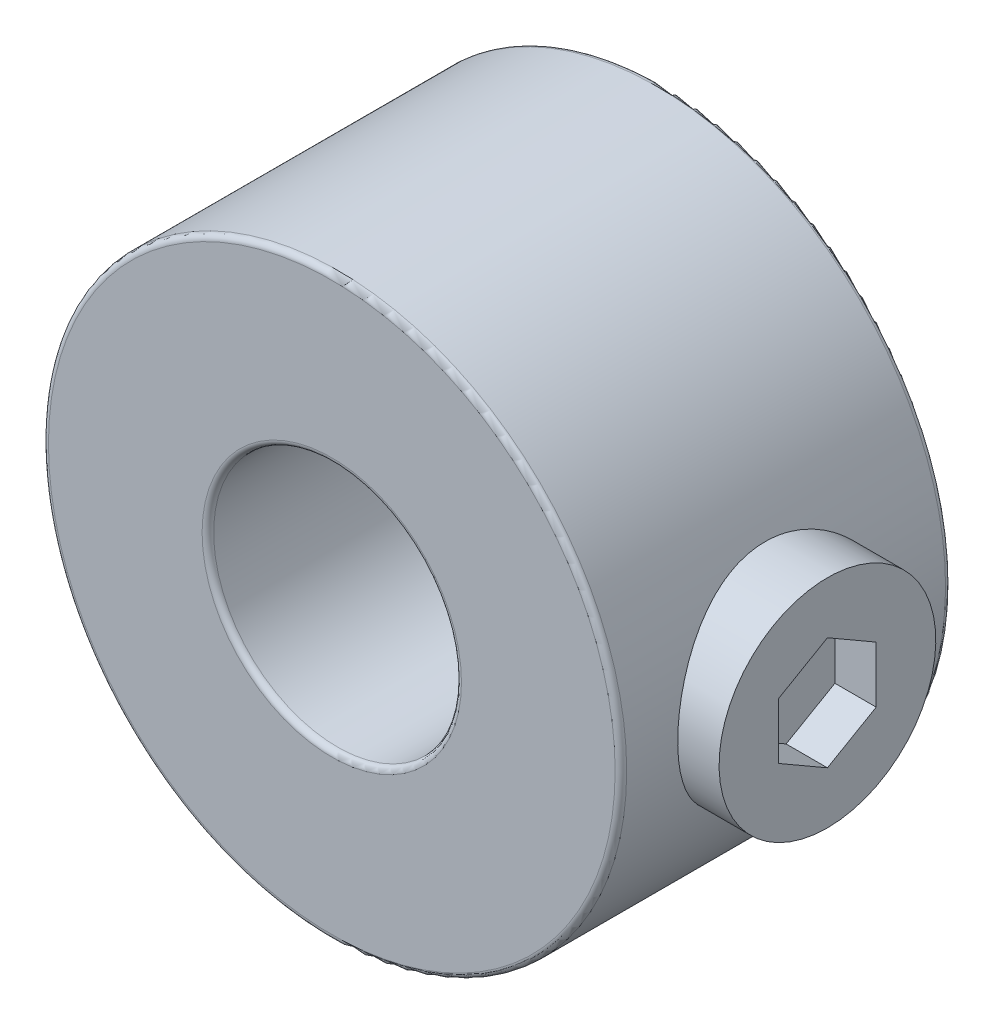
ISO-10303-21;
HEADER;
FILE_DESCRIPTION(('STEP AP214'),'2;1');
FILE_NAME('part.step','',(''),(''),'','','');
FILE_SCHEMA(('AUTOMOTIVE_DESIGN { 1 0 10303 214 1 1 1 1 }'));
ENDSEC;
DATA;
#1=APPLICATION_CONTEXT('core data for automotive mechanical design processes');
#2=APPLICATION_PROTOCOL_DEFINITION('international standard','automotive_design',2000,#1);
#3=PRODUCT_CONTEXT('',#1,'mechanical');
#4=PRODUCT('Part','Part','',(#3));
#5=PRODUCT_RELATED_PRODUCT_CATEGORY('part','',(#4));
#6=PRODUCT_DEFINITION_FORMATION('','',#4);
#7=PRODUCT_DEFINITION_CONTEXT('part definition',#1,'design');
#8=PRODUCT_DEFINITION('design','',#6,#7);
#9=PRODUCT_DEFINITION_SHAPE('','',#8);
#10=(LENGTH_UNIT() NAMED_UNIT(*) SI_UNIT(.MILLI.,.METRE.));
#11=(NAMED_UNIT(*) PLANE_ANGLE_UNIT() SI_UNIT($,.RADIAN.));
#12=(NAMED_UNIT(*) SI_UNIT($,.STERADIAN.) SOLID_ANGLE_UNIT());
#13=UNCERTAINTY_MEASURE_WITH_UNIT(LENGTH_MEASURE(1.E-05),#10,'distance_accuracy_value','');
#14=(GEOMETRIC_REPRESENTATION_CONTEXT(3) GLOBAL_UNCERTAINTY_ASSIGNED_CONTEXT((#13)) GLOBAL_UNIT_ASSIGNED_CONTEXT((#10,
#11,#12)) REPRESENTATION_CONTEXT('',''));
#15=CARTESIAN_POINT('',(0.,0.,0.));
#16=DIRECTION('',(0.,0.,1.));
#17=DIRECTION('',(1.,0.,0.));
#18=AXIS2_PLACEMENT_3D('',#15,#16,#17);
#19=CARTESIAN_POINT('',(3.175,0.,3.175));
#20=DIRECTION('',(1.,0.,0.));
#21=DIRECTION('',(0.,1.,0.));
#22=AXIS2_PLACEMENT_3D('',#19,#20,#21);
#23=PLANE('',#22);
#24=CARTESIAN_POINT('',(3.175,0.,3.175));
#25=DIRECTION('',(-1.,0.,0.));
#26=DIRECTION('',(0.,-1.,0.));
#27=AXIS2_PLACEMENT_3D('',#24,#25,#26);
#28=CIRCLE('',#27,2.0828);
#29=CARTESIAN_POINT('',(3.17500000000001,-2.08280000000001,3.175));
#30=VERTEX_POINT('',#29);
#31=EDGE_CURVE('E12',#30,#30,#28,.T.);
#32=ORIENTED_EDGE('',*,*,#31,.T.);
#33=EDGE_LOOP('',(#32));
#34=FACE_BOUND('',#33,.T.);
#35=ADVANCED_FACE('F42',(#34),#23,.F.);
#36=CARTESIAN_POINT('',(3.175,0.,3.175));
#37=DIRECTION('',(-1.,0.,0.));
#38=DIRECTION('',(0.,-1.,0.));
#39=AXIS2_PLACEMENT_3D('',#36,#37,#38);
#40=CYLINDRICAL_SURFACE('',#39,2.0828);
#41=ORIENTED_EDGE('',*,*,#31,.F.);
#42=EDGE_LOOP('',(#41));
#43=FACE_BOUND('',#42,.T.);
#44=CARTESIAN_POINT('',(6.35,0.,3.175));
#45=DIRECTION('',(-1.,0.,0.));
#46=DIRECTION('',(0.,-1.,0.));
#47=AXIS2_PLACEMENT_3D('',#44,#45,#46);
#48=CIRCLE('',#47,2.08279999999999);
#49=CARTESIAN_POINT('',(6.35000000000001,-2.08279999999999,3.175));
#50=VERTEX_POINT('',#49);
#51=EDGE_CURVE('E49',#50,#50,#48,.T.);
#52=ORIENTED_EDGE('',*,*,#51,.T.);
#53=EDGE_LOOP('',(#52));
#54=FACE_BOUND('',#53,.T.);
#55=ADVANCED_FACE('F152',(#43,#54),#40,.T.);
#56=CARTESIAN_POINT('',(6.35,0.,3.175));
#57=DIRECTION('',(-1.,0.,0.));
#58=DIRECTION('',(0.,-1.,0.));
#59=AXIS2_PLACEMENT_3D('',#56,#57,#58);
#60=PLANE('',#59);
#61=DIRECTION('',(0.,-0.5,0.866025403784439));
#62=VECTOR('',#61,1.);
#63=CARTESIAN_POINT('',(6.35,1.08225462660142,3.175));
#64=LINE('',#63,#62);
#65=CARTESIAN_POINT('',(6.34999999999999,1.08225462660142,3.175));
#66=VERTEX_POINT('',#65);
#67=CARTESIAN_POINT('',(6.35,0.541127313300754,4.11226));
#68=VERTEX_POINT('',#67);
#69=EDGE_CURVE('E110',#66,#68,#64,.T.);
#70=ORIENTED_EDGE('',*,*,#69,.F.);
#71=DIRECTION('',(0.,0.5,0.866025403784438));
#72=VECTOR('',#71,1.);
#73=CARTESIAN_POINT('',(6.35,0.541127313300753,2.23774));
#74=LINE('',#73,#72);
#75=CARTESIAN_POINT('',(6.35,0.541127313300753,2.23774));
#76=VERTEX_POINT('',#75);
#77=EDGE_CURVE('E56',#76,#66,#74,.T.);
#78=ORIENTED_EDGE('',*,*,#77,.F.);
#79=DIRECTION('',(0.,1.,0.));
#80=VECTOR('',#79,1.);
#81=CARTESIAN_POINT('',(6.35,-0.541127313300583,2.23774));
#82=LINE('',#81,#80);
#83=CARTESIAN_POINT('',(6.35,-0.541127313300583,2.23774));
#84=VERTEX_POINT('',#83);
#85=EDGE_CURVE('E126',#84,#76,#82,.T.);
#86=ORIENTED_EDGE('',*,*,#85,.F.);
#87=DIRECTION('',(0.,0.5,-0.866025403784439));
#88=VECTOR('',#87,1.);
#89=CARTESIAN_POINT('',(6.35,-1.08225462660125,3.175));
#90=LINE('',#89,#88);
#91=CARTESIAN_POINT('',(6.35,-1.08225462660125,3.175));
#92=VERTEX_POINT('',#91);
#93=EDGE_CURVE('E120',#92,#84,#90,.T.);
#94=ORIENTED_EDGE('',*,*,#93,.F.);
#95=DIRECTION('',(0.,-0.5,-0.866025403784439));
#96=VECTOR('',#95,1.);
#97=CARTESIAN_POINT('',(6.35,-0.541127313300584,4.11226));
#98=LINE('',#97,#96);
#99=CARTESIAN_POINT('',(6.35,-0.541127313300584,4.11226));
#100=VERTEX_POINT('',#99);
#101=EDGE_CURVE('E118',#100,#92,#98,.T.);
#102=ORIENTED_EDGE('',*,*,#101,.F.);
#103=DIRECTION('',(0.,-1.,0.));
#104=VECTOR('',#103,1.);
#105=CARTESIAN_POINT('',(6.35,0.541127313300754,4.11226));
#106=LINE('',#105,#104);
#107=EDGE_CURVE('E99',#68,#100,#106,.T.);
#108=ORIENTED_EDGE('',*,*,#107,.F.);
#109=EDGE_LOOP('',(#70,#78,#86,#94,#102,#108));
#110=FACE_BOUND('',#109,.T.);
#111=ORIENTED_EDGE('',*,*,#51,.F.);
#112=EDGE_LOOP('',(#111));
#113=FACE_BOUND('',#112,.T.);
#114=ADVANCED_FACE('F114',(#110,#113),#60,.F.);
#115=CARTESIAN_POINT('',(5.55625,0.541127313300753,2.23774));
#116=DIRECTION('',(0.,0.866025403784438,-0.5));
#117=DIRECTION('',(0.,0.5,0.866025403784439));
#118=AXIS2_PLACEMENT_3D('',#115,#116,#117);
#119=PLANE('',#118);
#120=ORIENTED_EDGE('',*,*,#77,.T.);
#121=DIRECTION('',(1.,0.,0.));
#122=VECTOR('',#121,1.);
#123=CARTESIAN_POINT('',(5.55625,1.08225462660142,3.175));
#124=LINE('',#123,#122);
#125=CARTESIAN_POINT('',(5.55625,1.08225462660142,3.175));
#126=VERTEX_POINT('',#125);
#127=EDGE_CURVE('E107',#126,#66,#124,.T.);
#128=ORIENTED_EDGE('',*,*,#127,.F.);
#129=DIRECTION('',(0.,0.5,0.866025403784438));
#130=VECTOR('',#129,1.);
#131=CARTESIAN_POINT('',(5.55625,0.541127313300753,2.23774));
#132=LINE('',#131,#130);
#133=CARTESIAN_POINT('',(5.55625,0.541127313300753,2.23774));
#134=VERTEX_POINT('',#133);
#135=EDGE_CURVE('E128',#134,#126,#132,.T.);
#136=ORIENTED_EDGE('',*,*,#135,.F.);
#137=DIRECTION('',(1.,0.,0.));
#138=VECTOR('',#137,1.);
#139=CARTESIAN_POINT('',(5.55625,0.541127313300753,2.23774));
#140=LINE('',#139,#138);
#141=EDGE_CURVE('E63',#134,#76,#140,.T.);
#142=ORIENTED_EDGE('',*,*,#141,.T.);
#143=EDGE_LOOP('',(#120,#128,#136,#142));
#144=FACE_BOUND('',#143,.T.);
#145=ADVANCED_FACE('F154',(#144),#119,.F.);
#146=CARTESIAN_POINT('',(5.55625,-0.541127313300583,2.23774));
#147=DIRECTION('',(0.,0.,-1.));
#148=DIRECTION('',(-1.,0.,0.));
#149=AXIS2_PLACEMENT_3D('',#146,#147,#148);
#150=PLANE('',#149);
#151=ORIENTED_EDGE('',*,*,#85,.T.);
#152=ORIENTED_EDGE('',*,*,#141,.F.);
#153=DIRECTION('',(0.,1.,0.));
#154=VECTOR('',#153,1.);
#155=CARTESIAN_POINT('',(5.55625,-0.541127313300583,2.23774));
#156=LINE('',#155,#154);
#157=CARTESIAN_POINT('',(5.55625,-0.541127313300583,2.23774));
#158=VERTEX_POINT('',#157);
#159=EDGE_CURVE('E140',#158,#134,#156,.T.);
#160=ORIENTED_EDGE('',*,*,#159,.F.);
#161=DIRECTION('',(1.,0.,0.));
#162=VECTOR('',#161,1.);
#163=CARTESIAN_POINT('',(5.55625,-0.541127313300583,2.23774));
#164=LINE('',#163,#162);
#165=EDGE_CURVE('E144',#158,#84,#164,.T.);
#166=ORIENTED_EDGE('',*,*,#165,.T.);
#167=EDGE_LOOP('',(#151,#152,#160,#166));
#168=FACE_BOUND('',#167,.T.);
#169=ADVANCED_FACE('F160',(#168),#150,.F.);
#170=CARTESIAN_POINT('',(5.55625,-1.08225462660125,3.175));
#171=DIRECTION('',(0.,-0.866025403784439,-0.5));
#172=DIRECTION('',(0.,0.5,-0.866025403784439));
#173=AXIS2_PLACEMENT_3D('',#170,#171,#172);
#174=PLANE('',#173);
#175=ORIENTED_EDGE('',*,*,#93,.T.);
#176=ORIENTED_EDGE('',*,*,#165,.F.);
#177=DIRECTION('',(0.,0.5,-0.866025403784439));
#178=VECTOR('',#177,1.);
#179=CARTESIAN_POINT('',(5.55625,-1.08225462660125,3.175));
#180=LINE('',#179,#178);
#181=CARTESIAN_POINT('',(5.55625,-1.08225462660125,3.175));
#182=VERTEX_POINT('',#181);
#183=EDGE_CURVE('E137',#182,#158,#180,.T.);
#184=ORIENTED_EDGE('',*,*,#183,.F.);
#185=DIRECTION('',(1.,0.,0.));
#186=VECTOR('',#185,1.);
#187=CARTESIAN_POINT('',(5.55625,-1.08225462660125,3.175));
#188=LINE('',#187,#186);
#189=EDGE_CURVE('E146',#182,#92,#188,.T.);
#190=ORIENTED_EDGE('',*,*,#189,.T.);
#191=EDGE_LOOP('',(#175,#176,#184,#190));
#192=FACE_BOUND('',#191,.T.);
#193=ADVANCED_FACE('F191',(#192),#174,.F.);
#194=CARTESIAN_POINT('',(5.55625,-0.541127313300584,4.11226));
#195=DIRECTION('',(0.,-0.866025403784439,0.5));
#196=DIRECTION('',(0.,-0.5,-0.866025403784439));
#197=AXIS2_PLACEMENT_3D('',#194,#195,#196);
#198=PLANE('',#197);
#199=ORIENTED_EDGE('',*,*,#101,.T.);
#200=ORIENTED_EDGE('',*,*,#189,.F.);
#201=DIRECTION('',(0.,-0.5,-0.866025403784439));
#202=VECTOR('',#201,1.);
#203=CARTESIAN_POINT('',(5.55625,-0.541127313300584,4.11226));
#204=LINE('',#203,#202);
#205=CARTESIAN_POINT('',(5.55625,-0.541127313300584,4.11226));
#206=VERTEX_POINT('',#205);
#207=EDGE_CURVE('E134',#206,#182,#204,.T.);
#208=ORIENTED_EDGE('',*,*,#207,.F.);
#209=DIRECTION('',(1.,0.,0.));
#210=VECTOR('',#209,1.);
#211=CARTESIAN_POINT('',(5.55625,-0.541127313300584,4.11226));
#212=LINE('',#211,#210);
#213=EDGE_CURVE('E106',#206,#100,#212,.T.);
#214=ORIENTED_EDGE('',*,*,#213,.T.);
#215=EDGE_LOOP('',(#199,#200,#208,#214));
#216=FACE_BOUND('',#215,.T.);
#217=ADVANCED_FACE('F200',(#216),#198,.F.);
#218=CARTESIAN_POINT('',(5.55625,0.541127313300754,4.11226));
#219=DIRECTION('',(0.,0.,1.));
#220=DIRECTION('',(1.,0.,0.));
#221=AXIS2_PLACEMENT_3D('',#218,#219,#220);
#222=PLANE('',#221);
#223=ORIENTED_EDGE('',*,*,#107,.T.);
#224=ORIENTED_EDGE('',*,*,#213,.F.);
#225=DIRECTION('',(0.,-1.,0.));
#226=VECTOR('',#225,1.);
#227=CARTESIAN_POINT('',(5.55625,0.541127313300754,4.11226));
#228=LINE('',#227,#226);
#229=CARTESIAN_POINT('',(5.55625,0.541127313300754,4.11226));
#230=VERTEX_POINT('',#229);
#231=EDGE_CURVE('E102',#230,#206,#228,.T.);
#232=ORIENTED_EDGE('',*,*,#231,.F.);
#233=DIRECTION('',(1.,0.,0.));
#234=VECTOR('',#233,1.);
#235=CARTESIAN_POINT('',(5.55625,0.541127313300754,4.11226));
#236=LINE('',#235,#234);
#237=EDGE_CURVE('E95',#230,#68,#236,.T.);
#238=ORIENTED_EDGE('',*,*,#237,.T.);
#239=EDGE_LOOP('',(#223,#224,#232,#238));
#240=FACE_BOUND('',#239,.T.);
#241=ADVANCED_FACE('F97',(#240),#222,.F.);
#242=CARTESIAN_POINT('',(5.55625,1.08225462660142,3.175));
#243=DIRECTION('',(0.,0.866025403784439,0.5));
#244=DIRECTION('',(0.,-0.5,0.866025403784439));
#245=AXIS2_PLACEMENT_3D('',#242,#243,#244);
#246=PLANE('',#245);
#247=ORIENTED_EDGE('',*,*,#69,.T.);
#248=ORIENTED_EDGE('',*,*,#237,.F.);
#249=DIRECTION('',(0.,-0.5,0.866025403784439));
#250=VECTOR('',#249,1.);
#251=CARTESIAN_POINT('',(5.55625,1.08225462660142,3.175));
#252=LINE('',#251,#250);
#253=EDGE_CURVE('E131',#126,#230,#252,.T.);
#254=ORIENTED_EDGE('',*,*,#253,.F.);
#255=ORIENTED_EDGE('',*,*,#127,.T.);
#256=EDGE_LOOP('',(#247,#248,#254,#255));
#257=FACE_BOUND('',#256,.T.);
#258=ADVANCED_FACE('F111',(#257),#246,.F.);
#259=CARTESIAN_POINT('',(5.55625,1.08225462660142,3.175));
#260=DIRECTION('',(1.,0.,0.));
#261=DIRECTION('',(0.,0.,-1.));
#262=AXIS2_PLACEMENT_3D('',#259,#260,#261);
#263=PLANE('',#262);
#264=ORIENTED_EDGE('',*,*,#135,.T.);
#265=ORIENTED_EDGE('',*,*,#253,.T.);
#266=ORIENTED_EDGE('',*,*,#231,.T.);
#267=ORIENTED_EDGE('',*,*,#207,.T.);
#268=ORIENTED_EDGE('',*,*,#183,.T.);
#269=ORIENTED_EDGE('',*,*,#159,.T.);
#270=EDGE_LOOP('',(#264,#265,#266,#267,#268,#269));
#271=FACE_BOUND('',#270,.T.);
#272=ADVANCED_FACE('F227',(#271),#263,.T.);
#273=CLOSED_SHELL('',(#35,#55,#114,#145,#169,#193,#217,#241,#258,#272));
#274=MANIFOLD_SOLID_BREP('B2',#273);
#275=CARTESIAN_POINT('',(0.,0.,6.35));
#276=DIRECTION('',(0.,0.,1.));
#277=DIRECTION('',(1.,0.,0.));
#278=AXIS2_PLACEMENT_3D('',#275,#276,#277);
#279=PLANE('',#278);
#280=CARTESIAN_POINT('',(0.,0.,6.35));
#281=DIRECTION('',(0.,0.,1.));
#282=DIRECTION('',(1.,0.,0.));
#283=AXIS2_PLACEMENT_3D('',#280,#281,#282);
#284=CIRCLE('',#283,2.492375);
#285=CARTESIAN_POINT('',(2.492375,0.,6.35));
#286=VERTEX_POINT('',#285);
#287=EDGE_CURVE('E260',#286,#286,#284,.F.);
#288=ORIENTED_EDGE('',*,*,#287,.T.);
#289=EDGE_LOOP('',(#288));
#290=FACE_BOUND('',#289,.T.);
#291=CARTESIAN_POINT('',(0.,0.,6.35));
#292=DIRECTION('',(0.,0.,1.));
#293=DIRECTION('',(1.,0.,0.));
#294=AXIS2_PLACEMENT_3D('',#291,#292,#293);
#295=CIRCLE('',#294,5.445125);
#296=CARTESIAN_POINT('',(5.445125,0.,6.35));
#297=VERTEX_POINT('',#296);
#298=EDGE_CURVE('E264',#297,#297,#295,.T.);
#299=ORIENTED_EDGE('',*,*,#298,.T.);
#300=EDGE_LOOP('',(#299));
#301=FACE_BOUND('',#300,.T.);
#302=ADVANCED_FACE('F248',(#290,#301),#279,.T.);
#303=CARTESIAN_POINT('',(0.,0.,0.));
#304=DIRECTION('',(0.,0.,1.));
#305=DIRECTION('',(1.,0.,0.));
#306=AXIS2_PLACEMENT_3D('',#303,#304,#305);
#307=PLANE('',#306);
#308=CARTESIAN_POINT('',(0.,0.,0.));
#309=DIRECTION('',(0.,0.,1.));
#310=DIRECTION('',(1.,0.,0.));
#311=AXIS2_PLACEMENT_3D('',#308,#309,#310);
#312=CIRCLE('',#311,2.492375);
#313=CARTESIAN_POINT('',(2.492375,0.,0.));
#314=VERTEX_POINT('',#313);
#315=EDGE_CURVE('E275',#314,#314,#312,.T.);
#316=ORIENTED_EDGE('',*,*,#315,.T.);
#317=EDGE_LOOP('',(#316));
#318=FACE_BOUND('',#317,.T.);
#319=CARTESIAN_POINT('',(0.,0.,0.));
#320=DIRECTION('',(0.,0.,1.));
#321=DIRECTION('',(1.,0.,0.));
#322=AXIS2_PLACEMENT_3D('',#319,#320,#321);
#323=CIRCLE('',#322,5.445125);
#324=CARTESIAN_POINT('',(5.445125,0.,0.));
#325=VERTEX_POINT('',#324);
#326=EDGE_CURVE('E278',#325,#325,#323,.F.);
#327=ORIENTED_EDGE('',*,*,#326,.T.);
#328=EDGE_LOOP('',(#327));
#329=FACE_BOUND('',#328,.T.);
#330=ADVANCED_FACE('F319',(#318,#329),#307,.F.);
#331=CARTESIAN_POINT('',(0.,0.,6.35));
#332=DIRECTION('',(0.,0.,-1.));
#333=DIRECTION('',(-1.,0.,0.));
#334=AXIS2_PLACEMENT_3D('',#331,#332,#333);
#335=CYLINDRICAL_SURFACE('',#334,5.55625);
#336=CARTESIAN_POINT('',(0.,0.,0.111125));
#337=DIRECTION('',(0.,0.,1.));
#338=DIRECTION('',(1.,0.,0.));
#339=AXIS2_PLACEMENT_3D('',#336,#337,#338);
#340=CIRCLE('',#339,5.55625);
#341=CARTESIAN_POINT('',(5.55625,0.,0.111125));
#342=VERTEX_POINT('',#341);
#343=EDGE_CURVE('E41',#342,#342,#340,.T.);
#344=ORIENTED_EDGE('',*,*,#343,.T.);
#345=EDGE_LOOP('',(#344));
#346=FACE_BOUND('',#345,.T.);
#347=CARTESIAN_POINT('',(0.,0.,6.238875));
#348=DIRECTION('',(0.,0.,1.));
#349=DIRECTION('',(1.,0.,0.));
#350=AXIS2_PLACEMENT_3D('',#347,#348,#349);
#351=CIRCLE('',#350,5.55625);
#352=CARTESIAN_POINT('',(5.55625,0.,6.238875));
#353=VERTEX_POINT('',#352);
#354=EDGE_CURVE('E256',#353,#353,#351,.F.);
#355=ORIENTED_EDGE('',*,*,#354,.T.);
#356=EDGE_LOOP('',(#355));
#357=FACE_BOUND('',#356,.T.);
#358=CARTESIAN_POINT('',(5.55625,0.,1.0922));
#359=CARTESIAN_POINT('',(5.55625300768121,-0.112800632930003,1.09219598464951));
#360=CARTESIAN_POINT('',(5.55278505962081,-0.22557375650504,1.10139225919862));
#361=CARTESIAN_POINT('',(5.5392973200522,-0.447749891057454,1.13778560564286));
#362=CARTESIAN_POINT('',(5.5292784668036,-0.557153382304329,1.1649800997327));
#363=CARTESIAN_POINT('',(5.50376437690656,-0.7693540019046,1.23627306928219));
#364=CARTESIAN_POINT('',(5.48827970334317,-0.872163424064122,1.28033895339468));
#365=CARTESIAN_POINT('',(5.4533764248173,-1.06892323856479,1.38395813774565));
#366=CARTESIAN_POINT('',(5.43395676586827,-1.16287124747356,1.44351558861812));
#367=CARTESIAN_POINT('',(5.39226740506347,-1.34322911463978,1.57906764812044));
#368=CARTESIAN_POINT('',(5.36991708646606,-1.42921302733438,1.65560397043158));
#369=CARTESIAN_POINT('',(5.3252823776817,-1.58746804313499,1.82179116944266));
#370=CARTESIAN_POINT('',(5.30299800969504,-1.65973495359077,1.91144604109283));
#371=CARTESIAN_POINT('',(5.2600804746529,-1.79121226481723,2.10548616897845));
#372=CARTESIAN_POINT('',(5.23954242039672,-1.84982111942715,2.21030216397591));
#373=CARTESIAN_POINT('',(5.20369722833776,-1.94838923392661,2.42919455246244));
#374=CARTESIAN_POINT('',(5.18838800368424,-1.98835593632194,2.54326722901722));
#375=CARTESIAN_POINT('',(5.16559576084147,-2.04682402169344,2.77253220975767));
#376=CARTESIAN_POINT('',(5.15781763095547,-2.06613822134155,2.88748689760805));
#377=CARTESIAN_POINT('',(5.15010472983807,-2.08529440426013,3.11924859045556));
#378=CARTESIAN_POINT('',(5.15016672255756,-2.08514442146683,3.23605481131787));
#379=CARTESIAN_POINT('',(5.15787259600182,-2.06599808773832,3.46076799212477));
#380=CARTESIAN_POINT('',(5.16506290320801,-2.04812917392808,3.56878945426515));
#381=CARTESIAN_POINT('',(5.18546148958707,-1.99591596349075,3.78017114950285));
#382=CARTESIAN_POINT('',(5.19867067431454,-1.96156918768861,3.88353067862862));
#383=CARTESIAN_POINT('',(5.2298919804838,-1.87675563584502,4.084953267714));
#384=CARTESIAN_POINT('',(5.24799020400401,-1.82599630573539,4.18287920704196));
#385=CARTESIAN_POINT('',(5.28692170218376,-1.71000247451572,4.36915076370434));
#386=CARTESIAN_POINT('',(5.3077559196341,-1.64476297834093,4.45749305937992));
#387=CARTESIAN_POINT('',(5.35151860221495,-1.4965021407131,4.62833045485081));
#388=CARTESIAN_POINT('',(5.37449375049466,-1.41258090144427,4.71003453035891));
#389=CARTESIAN_POINT('',(5.41874674251992,-1.23196365426747,4.85844452863914));
#390=CARTESIAN_POINT('',(5.44002432547937,-1.1352656895903,4.92514814983905));
#391=CARTESIAN_POINT('',(5.47890719997606,-0.929823331313822,5.04253532666365));
#392=CARTESIAN_POINT('',(5.49645071347302,-0.820915981682843,5.09295560812022));
#393=CARTESIAN_POINT('',(5.52543048412729,-0.595343579335005,5.17449665444985));
#394=CARTESIAN_POINT('',(5.53686945135909,-0.478681994972035,5.20562598440935));
#395=CARTESIAN_POINT('',(5.5518749936626,-0.247570187168622,5.24618115087403));
#396=CARTESIAN_POINT('',(5.55582753103965,-0.133331773827583,5.25667220007852));
#397=CARTESIAN_POINT('',(5.55660748535906,0.0953283436577319,5.258754441011));
#398=CARTESIAN_POINT('',(5.55343648058411,0.209750001589684,5.25034981923885));
#399=CARTESIAN_POINT('',(5.54058024960133,0.430926540416132,5.21568898213469));
#400=CARTESIAN_POINT('',(5.53114977163135,0.537807116159226,5.19013045938022));
#401=CARTESIAN_POINT('',(5.50697945787875,0.745687864829836,5.12280582513564));
#402=CARTESIAN_POINT('',(5.49223893155362,0.846687270958334,5.08103760560918));
#403=CARTESIAN_POINT('',(5.45836614698944,1.04326337793135,4.98114776949349));
#404=CARTESIAN_POINT('',(5.43911760327552,1.13859364241543,4.92258182189689));
#405=CARTESIAN_POINT('',(5.39835785558102,1.31839271067494,4.79126143061731));
#406=CARTESIAN_POINT('',(5.37684581806946,1.40285748760972,4.71850175161407));
#407=CARTESIAN_POINT('',(5.33237981787699,1.5636497571678,4.5558954905382));
#408=CARTESIAN_POINT('',(5.30941456183645,1.63922162799222,4.4653028632398));
#409=CARTESIAN_POINT('',(5.26583668916757,1.77423955261877,4.27227040858404));
#410=CARTESIAN_POINT('',(5.24522428302936,1.83368416430154,4.16982952290831));
#411=CARTESIAN_POINT('',(5.2087720132518,1.93481923474378,3.95516502995866));
#412=CARTESIAN_POINT('',(5.19295216591895,1.97643552425905,3.84290285032728));
#413=CARTESIAN_POINT('',(5.16835555583759,2.03990093033916,3.61220568147679));
#414=CARTESIAN_POINT('',(5.15957444069517,2.06176226343082,3.49377455515043));
#415=CARTESIAN_POINT('',(5.15062742767764,2.08400604935767,3.26228832853358));
#416=CARTESIAN_POINT('',(5.14994480894648,2.08567688417979,3.14937597700625));
#417=CARTESIAN_POINT('',(5.15594759760087,2.07079252565418,2.92496951870819));
#418=CARTESIAN_POINT('',(5.16263230744571,2.05423905778867,2.81347527868121));
#419=CARTESIAN_POINT('',(5.1821866620233,2.0043787434665,2.59851836245109));
#420=CARTESIAN_POINT('',(5.19486162518906,1.97159779594338,2.49491447425813));
#421=CARTESIAN_POINT('',(5.22485507472632,1.89067616429862,2.29461661554121));
#422=CARTESIAN_POINT('',(5.24217473437253,1.84253159866192,2.19792439876893));
#423=CARTESIAN_POINT('',(5.28063498027687,1.72932228141872,2.00868693927199));
#424=CARTESIAN_POINT('',(5.30192820905341,1.6635032144585,1.91662436057705));
#425=CARTESIAN_POINT('',(5.34541005082352,1.51798138023012,1.74443920680302));
#426=CARTESIAN_POINT('',(5.36759894655465,1.43827420211132,1.66432044011307));
#427=CARTESIAN_POINT('',(5.41181284852435,1.26208849099772,1.51388180974049));
#428=CARTESIAN_POINT('',(5.43376415796984,1.16493627252017,1.44432575025546));
#429=CARTESIAN_POINT('',(5.47376576077515,0.95955127043636,1.32255046739227));
#430=CARTESIAN_POINT('',(5.491815755515,0.851317639554694,1.27033257097246));
#431=CARTESIAN_POINT('',(5.5226027657999,0.62186338385069,1.18326055041905));
#432=CARTESIAN_POINT('',(5.53507803240463,0.500284487091534,1.14924935323932));
#433=CARTESIAN_POINT('',(5.55189793213197,0.252457334192373,1.10372695522375));
#434=CARTESIAN_POINT('',(5.55624663473698,0.126211447425829,1.09220449273363));
#435=CARTESIAN_POINT('',(5.55625,0.,1.0922));
#436=B_SPLINE_CURVE_WITH_KNOTS('',3,(#358,#359,#360,#361,#362,#363,#364,#365,#366,#367,#368,
#369,#370,#371,#372,#373,#374,#375,#376,#377,#378,#379,#380,#381,#382,#383,#384,#385,#386,#387,
#388,#389,#390,#391,#392,#393,#394,#395,#396,#397,#398,#399,#400,#401,#402,#403,#404,#405,#406,
#407,#408,#409,#410,#411,#412,#413,#414,#415,#416,#417,#418,#419,#420,#421,#422,#423,#424,#425,
#426,#427,#428,#429,#430,#431,#432,#433,#434,#435),.UNSPECIFIED.,.T.,.F.,(4,2,2,2,2,2,2,2,2,2,2,
2,2,2,2,2,2,2,2,2,2,2,2,2,2,2,2,2,2,2,2,2,2,2,2,2,2,2,4),(0.,0.337936375735737,
0.675824360812357,1.01306289665027,1.35039188157959,1.70062735361547,2.05096970458192,
2.41464480516559,2.77817459121935,3.12680120299707,3.47528391789854,3.80292943607456,
4.13062426559093,4.46451595605232,4.7985230049902,5.15495935990809,5.51145036684649,
5.87344604132048,6.23528087614685,6.57789186152054,6.92042694593843,7.24981241891746,
7.57924074213389,7.91834581789554,8.25757620897215,8.61647287895939,8.97540163135853,
9.33580942789548,9.69599419429639,10.0330639252718,10.3701017451327,10.6968689808505,
11.023718837565,11.3676926275184,11.7117758630099,12.0744589282966,12.4371697447618,
12.8154727091034,13.1935861825084),.UNSPECIFIED.);
#437=CARTESIAN_POINT('',(5.55625,0.,1.0922));
#438=VERTEX_POINT('',#437);
#439=EDGE_CURVE('E281',#438,#438,#436,.T.);
#440=ORIENTED_EDGE('',*,*,#439,.T.);
#441=EDGE_LOOP('',(#440));
#442=FACE_BOUND('',#441,.T.);
#443=ADVANCED_FACE('F250',(#346,#357,#442),#335,.T.);
#444=CARTESIAN_POINT('',(0.,0.,6.35));
#445=DIRECTION('',(0.,0.,-1.));
#446=DIRECTION('',(-1.,0.,0.));
#447=AXIS2_PLACEMENT_3D('',#444,#445,#446);
#448=CYLINDRICAL_SURFACE('',#447,2.38125);
#449=CARTESIAN_POINT('',(0.,0.,0.111125));
#450=DIRECTION('',(0.,0.,1.));
#451=DIRECTION('',(1.,0.,0.));
#452=AXIS2_PLACEMENT_3D('',#449,#450,#451);
#453=CIRCLE('',#452,2.38125);
#454=CARTESIAN_POINT('',(2.38125,0.,0.111125));
#455=VERTEX_POINT('',#454);
#456=EDGE_CURVE('E269',#455,#455,#453,.F.);
#457=ORIENTED_EDGE('',*,*,#456,.T.);
#458=EDGE_LOOP('',(#457));
#459=FACE_BOUND('',#458,.T.);
#460=CARTESIAN_POINT('',(0.,0.,6.238875));
#461=DIRECTION('',(0.,0.,1.));
#462=DIRECTION('',(1.,0.,0.));
#463=AXIS2_PLACEMENT_3D('',#460,#461,#462);
#464=CIRCLE('',#463,2.38125);
#465=CARTESIAN_POINT('',(2.38125,0.,6.238875));
#466=VERTEX_POINT('',#465);
#467=EDGE_CURVE('E272',#466,#466,#464,.T.);
#468=ORIENTED_EDGE('',*,*,#467,.T.);
#469=EDGE_LOOP('',(#468));
#470=FACE_BOUND('',#469,.T.);
#471=CARTESIAN_POINT('',(2.38125,0.,1.0922));
#472=CARTESIAN_POINT('',(2.38124169738782,-0.0973929494177684,1.0922084429082));
#473=CARTESIAN_POINT('',(2.37521781554013,-0.194878185940059,1.09908828117328));
#474=CARTESIAN_POINT('',(2.35164968767381,-0.386611258583446,1.12609735999015));
#475=CARTESIAN_POINT('',(2.3340880433526,-0.480853978952414,1.14624661018514));
#476=CARTESIAN_POINT('',(2.28905523455364,-0.662803659347758,1.19822335257069));
#477=CARTESIAN_POINT('',(2.2616485703984,-0.75054877728157,1.22997485461241));
#478=CARTESIAN_POINT('',(2.19878218385056,-0.918571873428455,1.30344819465286));
#479=CARTESIAN_POINT('',(2.1633205905272,-0.99884811071721,1.34517234913269));
#480=CARTESIAN_POINT('',(2.07129585780852,-1.18071922841444,1.45477177420981));
#481=CARTESIAN_POINT('',(2.01187811461961,-1.27853737094911,1.52651791524594));
#482=CARTESIAN_POINT('',(1.8858676186512,-1.45806357215512,1.68290268850811));
#483=CARTESIAN_POINT('',(1.81925619295102,-1.53972806694118,1.76757512136184));
#484=CARTESIAN_POINT('',(1.6819858226797,-1.68869453885767,1.9500270744846));
#485=CARTESIAN_POINT('',(1.61127039279957,-1.75564607190694,2.04805131695847));
#486=CARTESIAN_POINT('',(1.50800710053804,-1.84345429424187,2.20378369991373));
#487=CARTESIAN_POINT('',(1.47407256364515,-1.87060881961605,2.25711147853228));
#488=CARTESIAN_POINT('',(1.40829212459068,-1.92061526818784,2.36695593898473));
#489=CARTESIAN_POINT('',(1.37644464378392,-1.94347046844694,2.42347014897654));
#490=CARTESIAN_POINT('',(1.315511128209,-1.98524197738729,2.54181128548304));
#491=CARTESIAN_POINT('',(1.28653757816364,-2.0040184380061,2.60374713019228));
#492=CARTESIAN_POINT('',(1.23510794067766,-2.03611895045125,2.73160352059125));
#493=CARTESIAN_POINT('',(1.21263923840388,-2.04945357647637,2.79751605007527));
#494=CARTESIAN_POINT('',(1.18025423126636,-2.06824894331714,2.92251293211873));
#495=CARTESIAN_POINT('',(1.16893709122595,-2.07460644232956,2.9810841248858));
#496=CARTESIAN_POINT('',(1.1552262688524,-2.08227591133755,3.09956016638917));
#497=CARTESIAN_POINT('',(1.15281866733808,-2.08359575166085,3.15946278762499));
#498=CARTESIAN_POINT('',(1.15736954716532,-2.08106950061304,3.27877947309331));
#499=CARTESIAN_POINT('',(1.16432811809892,-2.07722335982678,3.338193532647));
#500=CARTESIAN_POINT('',(1.18633414982618,-2.06473187058197,3.45501103079392));
#501=CARTESIAN_POINT('',(1.2013977190641,-2.05607696372146,3.51241022206229));
#502=CARTESIAN_POINT('',(1.24843208844284,-2.02802431587873,3.65828569557154));
#503=CARTESIAN_POINT('',(1.28511818916214,-2.0052950866678,3.74455608093949));
#504=CARTESIAN_POINT('',(1.36659247872682,-1.95069238856915,3.9101993796659));
#505=CARTESIAN_POINT('',(1.41141433391192,-1.91878058772755,3.98954152323205));
#506=CARTESIAN_POINT('',(1.49540866711481,-1.85374053193307,4.12697914455121));
#507=CARTESIAN_POINT('',(1.53394908324056,-1.82209669171924,4.18617643344989));
#508=CARTESIAN_POINT('',(1.61186697150652,-1.75354977017389,4.30087193974644));
#509=CARTESIAN_POINT('',(1.65124490005754,-1.71664375526402,4.35636806830602));
#510=CARTESIAN_POINT('',(1.76880002686161,-1.59813215574373,4.51730349146105));
#511=CARTESIAN_POINT('',(1.84657107217174,-1.50860748259121,4.61745348058046));
#512=CARTESIAN_POINT('',(1.97680164405595,-1.33111081686615,4.78036484894449));
#513=CARTESIAN_POINT('',(2.03099147770901,-1.24743041186449,4.84644637043296));
#514=CARTESIAN_POINT('',(2.13105292684302,-1.06747624024202,4.96670691658156));
#515=CARTESIAN_POINT('',(2.17693881588416,-0.971224582250843,5.02090639972253));
#516=CARTESIAN_POINT('',(2.24937750645811,-0.786487670098548,5.10574791918545));
#517=CARTESIAN_POINT('',(2.27794385536502,-0.699954147004292,5.13890422775058));
#518=CARTESIAN_POINT('',(2.32544428673337,-0.520793119382108,5.1938083522579));
#519=CARTESIAN_POINT('',(2.34438404693158,-0.428169243423065,5.21556289316922));
#520=CARTESIAN_POINT('',(2.37119511602025,-0.238703740611494,5.24631064044599));
#521=CARTESIAN_POINT('',(2.37900740222367,-0.141842410931578,5.25523579908841));
#522=CARTESIAN_POINT('',(2.38265255041335,0.0523955060058459,5.25940375485637));
#523=CARTESIAN_POINT('',(2.37848799554894,0.14977197763656,5.25464950233922));
#524=CARTESIAN_POINT('',(2.35944401934361,0.333417297278395,5.23283976327474));
#525=CARTESIAN_POINT('',(2.34551655690229,0.419921362705576,5.21687697729471));
#526=CARTESIAN_POINT('',(2.30899723417267,0.588497013987461,5.17482015891983));
#527=CARTESIAN_POINT('',(2.28640295393225,0.670567354547545,5.14872329685926));
#528=CARTESIAN_POINT('',(2.23214619164943,0.834142460455979,5.08561768628117));
#529=CARTESIAN_POINT('',(2.19997605475041,0.915238018142445,5.04799313522873));
#530=CARTESIAN_POINT('',(2.12914358486451,1.06973790107797,4.96425944566484));
#531=CARTESIAN_POINT('',(2.09048059465548,1.14314144650041,4.91814944819089));
#532=CARTESIAN_POINT('',(1.9871854205343,1.31770085106055,4.79316159612165));
#533=CARTESIAN_POINT('',(1.91942197272719,1.41372053301884,4.70962557700655));
#534=CARTESIAN_POINT('',(1.8136716925882,1.54405950381832,4.57424808150429));
#535=CARTESIAN_POINT('',(1.77761865067373,1.58533102215397,4.52728117053609));
#536=CARTESIAN_POINT('',(1.70488698426772,1.66329341929084,4.43014334461922));
#537=CARTESIAN_POINT('',(1.66820862694579,1.69998620126694,4.37997377406766));
#538=CARTESIAN_POINT('',(1.59420288842061,1.76960725317859,4.2752695655651));
#539=CARTESIAN_POINT('',(1.55688016476042,1.80242857649599,4.22066071337522));
#540=CARTESIAN_POINT('',(1.4835102025302,1.86328181449458,4.10792228861507));
#541=CARTESIAN_POINT('',(1.44746409497991,1.89130956250531,4.04978971199448));
#542=CARTESIAN_POINT('',(1.37844995486942,1.94217659913758,3.93012052062042));
#543=CARTESIAN_POINT('',(1.3454627318646,1.96504973641606,3.86860962202164));
#544=CARTESIAN_POINT('',(1.28457172881988,2.00538160065762,3.74150878354459));
#545=CARTESIAN_POINT('',(1.25665685838627,2.02285220015144,3.67592817384003));
#546=CARTESIAN_POINT('',(1.2123667058382,2.0496582830042,3.54984361991123));
#547=CARTESIAN_POINT('',(1.19492816601373,2.05978578294623,3.48989624487153));
#548=CARTESIAN_POINT('',(1.16869725413226,2.07478566572983,3.36759012682094));
#549=CARTESIAN_POINT('',(1.15987788333445,2.07967446298945,3.30523955365327));
#550=CARTESIAN_POINT('',(1.15254090780492,2.08375269156674,3.179288322483));
#551=CARTESIAN_POINT('',(1.1540921030598,2.08290405944575,3.11568211262847));
#552=CARTESIAN_POINT('',(1.16732270014717,2.07551385144013,2.98981038516355));
#553=CARTESIAN_POINT('',(1.17902456029836,2.06895965188869,2.9275481543754));
#554=CARTESIAN_POINT('',(1.21570302773611,2.04767916863798,2.78531011180082));
#555=CARTESIAN_POINT('',(1.2438353446188,2.03093551241328,2.70648628485827));
#556=CARTESIAN_POINT('',(1.30863834272883,1.98979629912138,2.55450529771601));
#557=CARTESIAN_POINT('',(1.34533915063776,1.9653736352152,2.48136937455745));
#558=CARTESIAN_POINT('',(1.41785547231986,1.91356980551128,2.35003458539317));
#559=CARTESIAN_POINT('',(1.4530980737846,1.88705797907478,2.29116503076972));
#560=CARTESIAN_POINT('',(1.52528107014582,1.8292121879698,2.17693183281721));
#561=CARTESIAN_POINT('',(1.56222253875031,1.79787514348515,2.12157046075532));
#562=CARTESIAN_POINT('',(1.67384383452983,1.69665819336629,1.9602758599977));
#563=CARTESIAN_POINT('',(1.74928782949524,1.61959432285363,1.85918659713851));
#564=CARTESIAN_POINT('',(1.85983884162358,1.48822384645095,1.71636967967083));
#565=CARTESIAN_POINT('',(1.89684411149743,1.4408786146688,1.6695348559237));
#566=CARTESIAN_POINT('',(1.96874057468971,1.34096632706359,1.57989066797926));
#567=CARTESIAN_POINT('',(2.00363125855725,1.28839802087374,1.53708227247789));
#568=CARTESIAN_POINT('',(2.07031900817937,1.17824656479344,1.45615024582956));
#569=CARTESIAN_POINT('',(2.10212528814672,1.12067939056976,1.41801256581834));
#570=CARTESIAN_POINT('',(2.16186908245016,1.00058397361573,1.34695394729951));
#571=CARTESIAN_POINT('',(2.18980944962631,0.938059443332618,1.31402915933507));
#572=CARTESIAN_POINT('',(2.24777766410769,0.790977928866077,1.2461140704693));
#573=CARTESIAN_POINT('',(2.27636857877807,0.704997759222654,1.21292241393405));
#574=CARTESIAN_POINT('',(2.32400023300291,0.527079025043952,1.15785526133258));
#575=CARTESIAN_POINT('',(2.34306134653871,0.435153650556685,1.13595562063528));
#576=CARTESIAN_POINT('',(2.36476314935842,0.28542032112445,1.1110649196227));
#577=CARTESIAN_POINT('',(2.37092471414508,0.228760591425691,1.10401142151783));
#578=CARTESIAN_POINT('',(2.37917111245811,0.114744706268643,1.09457587052268));
#579=CARTESIAN_POINT('',(2.38125489227836,0.0573883746588271,1.09219502505282));
#580=CARTESIAN_POINT('',(2.38125,0.,1.0922));
#581=B_SPLINE_CURVE_WITH_KNOTS('',3,(#471,#472,#473,#474,#475,#476,#477,#478,#479,#480,#481,
#482,#483,#484,#485,#486,#487,#488,#489,#490,#491,#492,#493,#494,#495,#496,#497,#498,#499,#500,
#501,#502,#503,#504,#505,#506,#507,#508,#509,#510,#511,#512,#513,#514,#515,#516,#517,#518,#519,
#520,#521,#522,#523,#524,#525,#526,#527,#528,#529,#530,#531,#532,#533,#534,#535,#536,#537,#538,
#539,#540,#541,#542,#543,#544,#545,#546,#547,#548,#549,#550,#551,#552,#553,#554,#555,#556,#557,
#558,#559,#560,#561,#562,#563,#564,#565,#566,#567,#568,#569,#570,#571,#572,#573,#574,#575,#576,
#577,#578,#579,#580),.UNSPECIFIED.,.T.,.F.,(4,2,2,2,2,2,2,2,2,2,2,2,2,2,2,2,2,2,2,2,2,2,2,2,2,2,
2,2,2,2,2,2,2,2,2,2,2,2,2,2,2,2,2,2,2,2,2,2,2,2,2,2,2,2,4),(0.,0.291929711342343,
0.58430064993809,0.874790027325908,1.16534694624727,1.56837900822509,1.97248359449051,
2.38536452655197,2.59157374397293,2.79762514057513,3.00990117495868,3.22176274230701,
3.40097377884003,3.57990471932577,3.75883737138585,3.93812696754524,4.22587741511078,
4.51484692790011,4.74675739511066,4.97879765790317,5.44187208922128,5.799462901991,
6.15643309346529,6.44616874974179,6.73573332181494,7.02682816327967,7.31786022650055,
7.5838716963478,7.84995749614861,8.13393766881313,8.41794660397488,8.84798340841046,
9.06435388091429,9.28063411622926,9.50192653001933,9.7234103286074,9.94339434198578,
10.1628914289343,10.3519596179131,10.5404336519238,10.7301592876982,10.9203057646936,
11.174924708459,11.4304527415466,11.6508244298292,11.871337363421,12.3125626795701,
12.5408899107377,12.7692719341217,12.9969492035042,13.2244575525955,13.5127540306651,
13.8004314888478,13.9724053775137,14.1444236986417),.UNSPECIFIED.);
#582=CARTESIAN_POINT('',(2.38125,0.,1.0922));
#583=VERTEX_POINT('',#582);
#584=EDGE_CURVE('E282',#583,#583,#581,.T.);
#585=ORIENTED_EDGE('',*,*,#584,.F.);
#586=EDGE_LOOP('',(#585));
#587=FACE_BOUND('',#586,.T.);
#588=ADVANCED_FACE('F291',(#459,#470,#587),#448,.F.);
#589=CARTESIAN_POINT('',(-5.89104801542137,0.,3.175));
#590=DIRECTION('',(1.,0.,0.));
#591=DIRECTION('',(0.,0.,-1.));
#592=AXIS2_PLACEMENT_3D('',#589,#590,#591);
#593=CYLINDRICAL_SURFACE('',#592,2.0828);
#594=ORIENTED_EDGE('',*,*,#584,.T.);
#595=EDGE_LOOP('',(#594));
#596=FACE_BOUND('',#595,.T.);
#597=ORIENTED_EDGE('',*,*,#439,.F.);
#598=EDGE_LOOP('',(#597));
#599=FACE_BOUND('',#598,.T.);
#600=ADVANCED_FACE('F294',(#596,#599),#593,.F.);
#601=CARTESIAN_POINT('',(0.,0.,0.111125));
#602=DIRECTION('',(0.,0.,1.));
#603=DIRECTION('',(1.,0.,0.));
#604=AXIS2_PLACEMENT_3D('',#601,#602,#603);
#605=TOROIDAL_SURFACE('',#604,2.492375,0.111125);
#606=ORIENTED_EDGE('',*,*,#456,.F.);
#607=EDGE_LOOP('',(#606));
#608=FACE_BOUND('',#607,.T.);
#609=ORIENTED_EDGE('',*,*,#315,.F.);
#610=EDGE_LOOP('',(#609));
#611=FACE_BOUND('',#610,.T.);
#612=ADVANCED_FACE('F298',(#608,#611),#605,.T.);
#613=CARTESIAN_POINT('',(0.,0.,6.238875));
#614=DIRECTION('',(0.,0.,1.));
#615=DIRECTION('',(1.,0.,0.));
#616=AXIS2_PLACEMENT_3D('',#613,#614,#615);
#617=TOROIDAL_SURFACE('',#616,2.492375,0.111125);
#618=ORIENTED_EDGE('',*,*,#287,.F.);
#619=EDGE_LOOP('',(#618));
#620=FACE_BOUND('',#619,.T.);
#621=ORIENTED_EDGE('',*,*,#467,.F.);
#622=EDGE_LOOP('',(#621));
#623=FACE_BOUND('',#622,.T.);
#624=ADVANCED_FACE('F303',(#620,#623),#617,.T.);
#625=CARTESIAN_POINT('',(0.,0.,0.111125));
#626=DIRECTION('',(0.,0.,1.));
#627=DIRECTION('',(1.,0.,0.));
#628=AXIS2_PLACEMENT_3D('',#625,#626,#627);
#629=TOROIDAL_SURFACE('',#628,5.445125,0.111125);
#630=ORIENTED_EDGE('',*,*,#326,.F.);
#631=EDGE_LOOP('',(#630));
#632=FACE_BOUND('',#631,.T.);
#633=ORIENTED_EDGE('',*,*,#343,.F.);
#634=EDGE_LOOP('',(#633));
#635=FACE_BOUND('',#634,.T.);
#636=ADVANCED_FACE('F307',(#632,#635),#629,.T.);
#637=CARTESIAN_POINT('',(0.,0.,6.238875));
#638=DIRECTION('',(0.,0.,1.));
#639=DIRECTION('',(1.,0.,0.));
#640=AXIS2_PLACEMENT_3D('',#637,#638,#639);
#641=TOROIDAL_SURFACE('',#640,5.445125,0.111125);
#642=ORIENTED_EDGE('',*,*,#354,.F.);
#643=EDGE_LOOP('',(#642));
#644=FACE_BOUND('',#643,.T.);
#645=ORIENTED_EDGE('',*,*,#298,.F.);
#646=EDGE_LOOP('',(#645));
#647=FACE_BOUND('',#646,.T.);
#648=ADVANCED_FACE('F311',(#644,#647),#641,.T.);
#649=CLOSED_SHELL('',(#302,#330,#443,#588,#600,#612,#624,#636,#648));
#650=MANIFOLD_SOLID_BREP('B6',#649);
#651=ADVANCED_BREP_SHAPE_REPRESENTATION('',(#18,#274,#650),#14);
#652=SHAPE_DEFINITION_REPRESENTATION(#9,#651);
ENDSEC;
END-ISO-10303-21;
